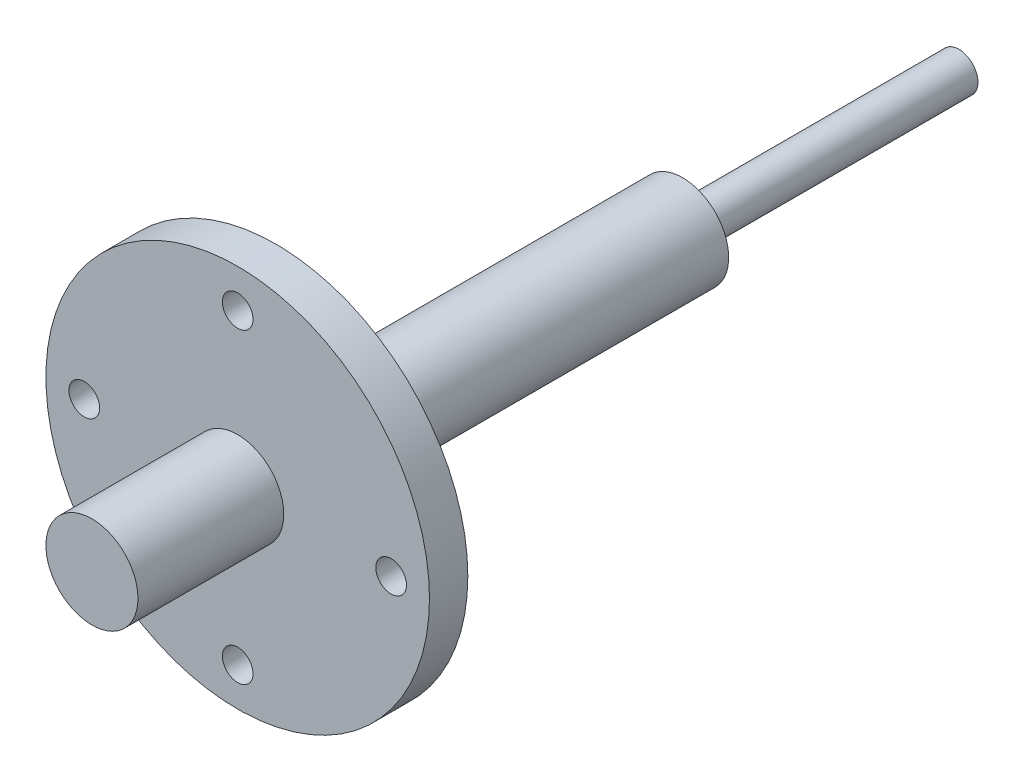
ISO-10303-21;
HEADER;
FILE_DESCRIPTION(('STEP AP214'),'2;1');
FILE_NAME('part.step','',(''),(''),'','','');
FILE_SCHEMA(('AUTOMOTIVE_DESIGN { 1 0 10303 214 1 1 1 1 }'));
ENDSEC;
DATA;
#1=APPLICATION_CONTEXT('core data for automotive mechanical design processes');
#2=APPLICATION_PROTOCOL_DEFINITION('international standard','automotive_design',2000,#1);
#3=PRODUCT_CONTEXT('',#1,'mechanical');
#4=PRODUCT('Part','Part','',(#3));
#5=PRODUCT_RELATED_PRODUCT_CATEGORY('part','',(#4));
#6=PRODUCT_DEFINITION_FORMATION('','',#4);
#7=PRODUCT_DEFINITION_CONTEXT('part definition',#1,'design');
#8=PRODUCT_DEFINITION('design','',#6,#7);
#9=PRODUCT_DEFINITION_SHAPE('','',#8);
#10=(LENGTH_UNIT() NAMED_UNIT(*) SI_UNIT(.MILLI.,.METRE.));
#11=(NAMED_UNIT(*) PLANE_ANGLE_UNIT() SI_UNIT($,.RADIAN.));
#12=(NAMED_UNIT(*) SI_UNIT($,.STERADIAN.) SOLID_ANGLE_UNIT());
#13=UNCERTAINTY_MEASURE_WITH_UNIT(LENGTH_MEASURE(1.E-05),#10,'distance_accuracy_value','');
#14=(GEOMETRIC_REPRESENTATION_CONTEXT(3) GLOBAL_UNCERTAINTY_ASSIGNED_CONTEXT((#13)) GLOBAL_UNIT_ASSIGNED_CONTEXT((#10,
#11,#12)) REPRESENTATION_CONTEXT('',''));
#15=CARTESIAN_POINT('',(0.,0.,0.));
#16=DIRECTION('',(0.,0.,1.));
#17=DIRECTION('',(1.,0.,0.));
#18=AXIS2_PLACEMENT_3D('',#15,#16,#17);
#19=CARTESIAN_POINT('',(0.,0.,89.));
#20=DIRECTION('',(0.,0.,-1.));
#21=DIRECTION('',(-1.,0.,0.));
#22=AXIS2_PLACEMENT_3D('',#19,#20,#21);
#23=CYLINDRICAL_SURFACE('',#22,6.);
#24=CARTESIAN_POINT('',(0.,0.,89.));
#25=DIRECTION('',(0.,0.,1.));
#26=DIRECTION('',(1.,0.,0.));
#27=AXIS2_PLACEMENT_3D('',#24,#25,#26);
#28=CIRCLE('',#27,6.);
#29=CARTESIAN_POINT('',(6.,0.,89.));
#30=VERTEX_POINT('',#29);
#31=EDGE_CURVE('E54',#30,#30,#28,.T.);
#32=ORIENTED_EDGE('',*,*,#31,.F.);
#33=EDGE_LOOP('',(#32));
#34=FACE_BOUND('',#33,.T.);
#35=CARTESIAN_POINT('',(0.,0.,36.));
#36=DIRECTION('',(0.,0.,-1.));
#37=DIRECTION('',(-1.,0.,0.));
#38=AXIS2_PLACEMENT_3D('',#35,#36,#37);
#39=CIRCLE('',#38,6.);
#40=CARTESIAN_POINT('',(-6.,0.,36.));
#41=VERTEX_POINT('',#40);
#42=EDGE_CURVE('E58',#41,#41,#39,.T.);
#43=ORIENTED_EDGE('',*,*,#42,.F.);
#44=EDGE_LOOP('',(#43));
#45=FACE_BOUND('',#44,.T.);
#46=ADVANCED_FACE('F34',(#34,#45),#23,.T.);
#47=CARTESIAN_POINT('',(0.,0.,113.));
#48=DIRECTION('',(0.,0.,-1.));
#49=DIRECTION('',(-1.,0.,0.));
#50=AXIS2_PLACEMENT_3D('',#47,#48,#49);
#51=CYLINDRICAL_SURFACE('',#50,25.);
#52=CARTESIAN_POINT('',(0.,0.,89.));
#53=DIRECTION('',(0.,0.,1.));
#54=DIRECTION('',(1.,0.,0.));
#55=AXIS2_PLACEMENT_3D('',#52,#53,#54);
#56=CIRCLE('',#55,25.);
#57=CARTESIAN_POINT('',(25.,0.,89.));
#58=VERTEX_POINT('',#57);
#59=EDGE_CURVE('E51',#58,#58,#56,.T.);
#60=ORIENTED_EDGE('',*,*,#59,.T.);
#61=EDGE_LOOP('',(#60));
#62=FACE_BOUND('',#61,.T.);
#63=CARTESIAN_POINT('',(0.,0.,94.));
#64=DIRECTION('',(0.,0.,1.));
#65=DIRECTION('',(1.,0.,0.));
#66=AXIS2_PLACEMENT_3D('',#63,#64,#65);
#67=CIRCLE('',#66,25.);
#68=CARTESIAN_POINT('',(25.,0.,94.));
#69=VERTEX_POINT('',#68);
#70=EDGE_CURVE('E11',#69,#69,#67,.T.);
#71=ORIENTED_EDGE('',*,*,#70,.F.);
#72=EDGE_LOOP('',(#71));
#73=FACE_BOUND('',#72,.T.);
#74=ADVANCED_FACE('F36',(#62,#73),#51,.T.);
#75=CARTESIAN_POINT('',(0.,0.,94.));
#76=DIRECTION('',(0.,0.,1.));
#77=DIRECTION('',(1.,0.,0.));
#78=AXIS2_PLACEMENT_3D('',#75,#76,#77);
#79=PLANE('',#78);
#80=CARTESIAN_POINT('',(20.,2.09489001666563E-13,94.));
#81=DIRECTION('',(0.,0.,1.));
#82=DIRECTION('',(0.,-1.,0.));
#83=AXIS2_PLACEMENT_3D('',#80,#81,#82);
#84=CIRCLE('',#83,2.);
#85=CARTESIAN_POINT('',(20.,-1.99999999999979,94.));
#86=VERTEX_POINT('',#85);
#87=EDGE_CURVE('E81',#86,#86,#84,.T.);
#88=ORIENTED_EDGE('',*,*,#87,.F.);
#89=EDGE_LOOP('',(#88));
#90=FACE_BOUND('',#89,.T.);
#91=CARTESIAN_POINT('',(0.,-20.,94.));
#92=DIRECTION('',(0.,0.,1.));
#93=DIRECTION('',(-1.,0.,0.));
#94=AXIS2_PLACEMENT_3D('',#91,#92,#93);
#95=CIRCLE('',#94,2.);
#96=CARTESIAN_POINT('',(-2.,-20.,94.));
#97=VERTEX_POINT('',#96);
#98=EDGE_CURVE('E71',#97,#97,#95,.T.);
#99=ORIENTED_EDGE('',*,*,#98,.F.);
#100=EDGE_LOOP('',(#99));
#101=FACE_BOUND('',#100,.T.);
#102=CARTESIAN_POINT('',(-20.,0.,94.));
#103=DIRECTION('',(0.,0.,1.));
#104=DIRECTION('',(0.,1.,0.));
#105=AXIS2_PLACEMENT_3D('',#102,#103,#104);
#106=CIRCLE('',#105,2.);
#107=CARTESIAN_POINT('',(-20.,1.99999999999993,94.));
#108=VERTEX_POINT('',#107);
#109=EDGE_CURVE('E68',#108,#108,#106,.T.);
#110=ORIENTED_EDGE('',*,*,#109,.F.);
#111=EDGE_LOOP('',(#110));
#112=FACE_BOUND('',#111,.T.);
#113=CARTESIAN_POINT('',(0.,20.,94.));
#114=DIRECTION('',(0.,0.,1.));
#115=DIRECTION('',(1.,0.,0.));
#116=AXIS2_PLACEMENT_3D('',#113,#114,#115);
#117=CIRCLE('',#116,2.);
#118=CARTESIAN_POINT('',(2.,20.,94.));
#119=VERTEX_POINT('',#118);
#120=EDGE_CURVE('E65',#119,#119,#117,.T.);
#121=ORIENTED_EDGE('',*,*,#120,.F.);
#122=EDGE_LOOP('',(#121));
#123=FACE_BOUND('',#122,.T.);
#124=CARTESIAN_POINT('',(0.,0.,94.));
#125=DIRECTION('',(0.,0.,1.));
#126=DIRECTION('',(1.,0.,0.));
#127=AXIS2_PLACEMENT_3D('',#124,#125,#126);
#128=CIRCLE('',#127,6.);
#129=CARTESIAN_POINT('',(6.,0.,94.));
#130=VERTEX_POINT('',#129);
#131=EDGE_CURVE('E42',#130,#130,#128,.T.);
#132=ORIENTED_EDGE('',*,*,#131,.F.);
#133=EDGE_LOOP('',(#132));
#134=FACE_BOUND('',#133,.T.);
#135=ORIENTED_EDGE('',*,*,#70,.T.);
#136=EDGE_LOOP('',(#135));
#137=FACE_BOUND('',#136,.T.);
#138=ADVANCED_FACE('F123',(#90,#101,#112,#123,#134,#137),#79,.T.);
#139=CARTESIAN_POINT('',(0.,0.,94.));
#140=DIRECTION('',(0.,0.,1.));
#141=DIRECTION('',(1.,0.,0.));
#142=AXIS2_PLACEMENT_3D('',#139,#140,#141);
#143=CYLINDRICAL_SURFACE('',#142,6.);
#144=ORIENTED_EDGE('',*,*,#131,.T.);
#145=EDGE_LOOP('',(#144));
#146=FACE_BOUND('',#145,.T.);
#147=CARTESIAN_POINT('',(0.,0.,113.));
#148=DIRECTION('',(0.,0.,1.));
#149=DIRECTION('',(1.,0.,0.));
#150=AXIS2_PLACEMENT_3D('',#147,#148,#149);
#151=CIRCLE('',#150,6.);
#152=CARTESIAN_POINT('',(6.,0.,113.));
#153=VERTEX_POINT('',#152);
#154=EDGE_CURVE('E47',#153,#153,#151,.T.);
#155=ORIENTED_EDGE('',*,*,#154,.F.);
#156=EDGE_LOOP('',(#155));
#157=FACE_BOUND('',#156,.T.);
#158=ADVANCED_FACE('F120',(#146,#157),#143,.T.);
#159=CARTESIAN_POINT('',(0.,0.,113.));
#160=DIRECTION('',(0.,0.,1.));
#161=DIRECTION('',(1.,0.,0.));
#162=AXIS2_PLACEMENT_3D('',#159,#160,#161);
#163=PLANE('',#162);
#164=ORIENTED_EDGE('',*,*,#154,.T.);
#165=EDGE_LOOP('',(#164));
#166=FACE_BOUND('',#165,.T.);
#167=ADVANCED_FACE('F112',(#166),#163,.T.);
#168=CARTESIAN_POINT('',(0.,0.,89.));
#169=DIRECTION('',(0.,0.,1.));
#170=DIRECTION('',(1.,0.,0.));
#171=AXIS2_PLACEMENT_3D('',#168,#169,#170);
#172=PLANE('',#171);
#173=CARTESIAN_POINT('',(20.,2.09489001666563E-13,89.));
#174=DIRECTION('',(0.,0.,1.));
#175=DIRECTION('',(1.,0.,0.));
#176=AXIS2_PLACEMENT_3D('',#173,#174,#175);
#177=CIRCLE('',#176,2.);
#178=CARTESIAN_POINT('',(22.,2.09489001666563E-13,89.));
#179=VERTEX_POINT('',#178);
#180=EDGE_CURVE('E38',#179,#179,#177,.T.);
#181=ORIENTED_EDGE('',*,*,#180,.T.);
#182=EDGE_LOOP('',(#181));
#183=FACE_BOUND('',#182,.T.);
#184=CARTESIAN_POINT('',(0.,-20.,89.));
#185=DIRECTION('',(0.,0.,1.));
#186=DIRECTION('',(1.,0.,0.));
#187=AXIS2_PLACEMENT_3D('',#184,#185,#186);
#188=CIRCLE('',#187,2.);
#189=CARTESIAN_POINT('',(2.,-20.,89.));
#190=VERTEX_POINT('',#189);
#191=EDGE_CURVE('E69',#190,#190,#188,.T.);
#192=ORIENTED_EDGE('',*,*,#191,.T.);
#193=EDGE_LOOP('',(#192));
#194=FACE_BOUND('',#193,.T.);
#195=CARTESIAN_POINT('',(-20.,0.,89.));
#196=DIRECTION('',(0.,0.,1.));
#197=DIRECTION('',(1.,0.,0.));
#198=AXIS2_PLACEMENT_3D('',#195,#196,#197);
#199=CIRCLE('',#198,2.);
#200=CARTESIAN_POINT('',(-18.,0.,89.));
#201=VERTEX_POINT('',#200);
#202=EDGE_CURVE('E66',#201,#201,#199,.T.);
#203=ORIENTED_EDGE('',*,*,#202,.T.);
#204=EDGE_LOOP('',(#203));
#205=FACE_BOUND('',#204,.T.);
#206=CARTESIAN_POINT('',(0.,20.,89.));
#207=DIRECTION('',(0.,0.,1.));
#208=DIRECTION('',(1.,0.,0.));
#209=AXIS2_PLACEMENT_3D('',#206,#207,#208);
#210=CIRCLE('',#209,2.);
#211=CARTESIAN_POINT('',(2.,20.,89.));
#212=VERTEX_POINT('',#211);
#213=EDGE_CURVE('E62',#212,#212,#210,.T.);
#214=ORIENTED_EDGE('',*,*,#213,.T.);
#215=EDGE_LOOP('',(#214));
#216=FACE_BOUND('',#215,.T.);
#217=ORIENTED_EDGE('',*,*,#31,.T.);
#218=EDGE_LOOP('',(#217));
#219=FACE_BOUND('',#218,.T.);
#220=ORIENTED_EDGE('',*,*,#59,.F.);
#221=EDGE_LOOP('',(#220));
#222=FACE_BOUND('',#221,.T.);
#223=ADVANCED_FACE('F91',(#183,#194,#205,#216,#219,#222),#172,.F.);
#224=CARTESIAN_POINT('',(0.,0.,36.));
#225=DIRECTION('',(0.,0.,-1.));
#226=DIRECTION('',(-1.,0.,0.));
#227=AXIS2_PLACEMENT_3D('',#224,#225,#226);
#228=PLANE('',#227);
#229=CARTESIAN_POINT('',(0.,0.,36.));
#230=DIRECTION('',(0.,0.,-1.));
#231=DIRECTION('',(-1.,0.,0.));
#232=AXIS2_PLACEMENT_3D('',#229,#230,#231);
#233=CIRCLE('',#232,2.5);
#234=CARTESIAN_POINT('',(-2.5,0.,36.));
#235=VERTEX_POINT('',#234);
#236=EDGE_CURVE('E59',#235,#235,#233,.T.);
#237=ORIENTED_EDGE('',*,*,#236,.F.);
#238=EDGE_LOOP('',(#237));
#239=FACE_BOUND('',#238,.T.);
#240=ORIENTED_EDGE('',*,*,#42,.T.);
#241=EDGE_LOOP('',(#240));
#242=FACE_BOUND('',#241,.T.);
#243=ADVANCED_FACE('F99',(#239,#242),#228,.T.);
#244=CARTESIAN_POINT('',(0.,0.,-36.));
#245=DIRECTION('',(0.,0.,1.));
#246=DIRECTION('',(1.,0.,0.));
#247=AXIS2_PLACEMENT_3D('',#244,#245,#246);
#248=CYLINDRICAL_SURFACE('',#247,2.5);
#249=ORIENTED_EDGE('',*,*,#236,.T.);
#250=EDGE_LOOP('',(#249));
#251=FACE_BOUND('',#250,.T.);
#252=CARTESIAN_POINT('',(0.,0.,0.));
#253=DIRECTION('',(0.,0.,1.));
#254=DIRECTION('',(1.,0.,0.));
#255=AXIS2_PLACEMENT_3D('',#252,#253,#254);
#256=CIRCLE('',#255,2.5);
#257=CARTESIAN_POINT('',(2.5,0.,0.));
#258=VERTEX_POINT('',#257);
#259=EDGE_CURVE('E55',#258,#258,#256,.F.);
#260=ORIENTED_EDGE('',*,*,#259,.F.);
#261=EDGE_LOOP('',(#260));
#262=FACE_BOUND('',#261,.T.);
#263=ADVANCED_FACE('F101',(#251,#262),#248,.T.);
#264=CARTESIAN_POINT('',(0.,0.,0.));
#265=DIRECTION('',(0.,0.,1.));
#266=DIRECTION('',(1.,0.,0.));
#267=AXIS2_PLACEMENT_3D('',#264,#265,#266);
#268=PLANE('',#267);
#269=ORIENTED_EDGE('',*,*,#259,.T.);
#270=EDGE_LOOP('',(#269));
#271=FACE_BOUND('',#270,.T.);
#272=ADVANCED_FACE('F108',(#271),#268,.F.);
#273=CARTESIAN_POINT('',(0.,20.,0.));
#274=DIRECTION('',(0.,0.,1.));
#275=DIRECTION('',(1.,0.,0.));
#276=AXIS2_PLACEMENT_3D('',#273,#274,#275);
#277=CYLINDRICAL_SURFACE('',#276,2.);
#278=ORIENTED_EDGE('',*,*,#120,.T.);
#279=EDGE_LOOP('',(#278));
#280=FACE_BOUND('',#279,.T.);
#281=ORIENTED_EDGE('',*,*,#213,.F.);
#282=EDGE_LOOP('',(#281));
#283=FACE_BOUND('',#282,.T.);
#284=ADVANCED_FACE('F117',(#280,#283),#277,.F.);
#285=CARTESIAN_POINT('',(-20.,0.,0.));
#286=DIRECTION('',(0.,0.,1.));
#287=DIRECTION('',(1.,0.,0.));
#288=AXIS2_PLACEMENT_3D('',#285,#286,#287);
#289=CYLINDRICAL_SURFACE('',#288,2.);
#290=ORIENTED_EDGE('',*,*,#109,.T.);
#291=EDGE_LOOP('',(#290));
#292=FACE_BOUND('',#291,.T.);
#293=ORIENTED_EDGE('',*,*,#202,.F.);
#294=EDGE_LOOP('',(#293));
#295=FACE_BOUND('',#294,.T.);
#296=ADVANCED_FACE('F137',(#292,#295),#289,.F.);
#297=CARTESIAN_POINT('',(0.,-20.,0.));
#298=DIRECTION('',(0.,0.,1.));
#299=DIRECTION('',(1.,0.,0.));
#300=AXIS2_PLACEMENT_3D('',#297,#298,#299);
#301=CYLINDRICAL_SURFACE('',#300,2.);
#302=ORIENTED_EDGE('',*,*,#98,.T.);
#303=EDGE_LOOP('',(#302));
#304=FACE_BOUND('',#303,.T.);
#305=ORIENTED_EDGE('',*,*,#191,.F.);
#306=EDGE_LOOP('',(#305));
#307=FACE_BOUND('',#306,.T.);
#308=ADVANCED_FACE('F143',(#304,#307),#301,.F.);
#309=CARTESIAN_POINT('',(20.,2.09489001666563E-13,0.));
#310=DIRECTION('',(0.,0.,1.));
#311=DIRECTION('',(1.,0.,0.));
#312=AXIS2_PLACEMENT_3D('',#309,#310,#311);
#313=CYLINDRICAL_SURFACE('',#312,2.);
#314=ORIENTED_EDGE('',*,*,#87,.T.);
#315=EDGE_LOOP('',(#314));
#316=FACE_BOUND('',#315,.T.);
#317=ORIENTED_EDGE('',*,*,#180,.F.);
#318=EDGE_LOOP('',(#317));
#319=FACE_BOUND('',#318,.T.);
#320=ADVANCED_FACE('F158',(#316,#319),#313,.F.);
#321=CLOSED_SHELL('',(#46,#74,#138,#158,#167,#223,#243,#263,#272,#284,#296,#308,#320));
#322=MANIFOLD_SOLID_BREP('B2',#321);
#323=ADVANCED_BREP_SHAPE_REPRESENTATION('',(#18,#322),#14);
#324=SHAPE_DEFINITION_REPRESENTATION(#9,#323);
ENDSEC;
END-ISO-10303-21;
